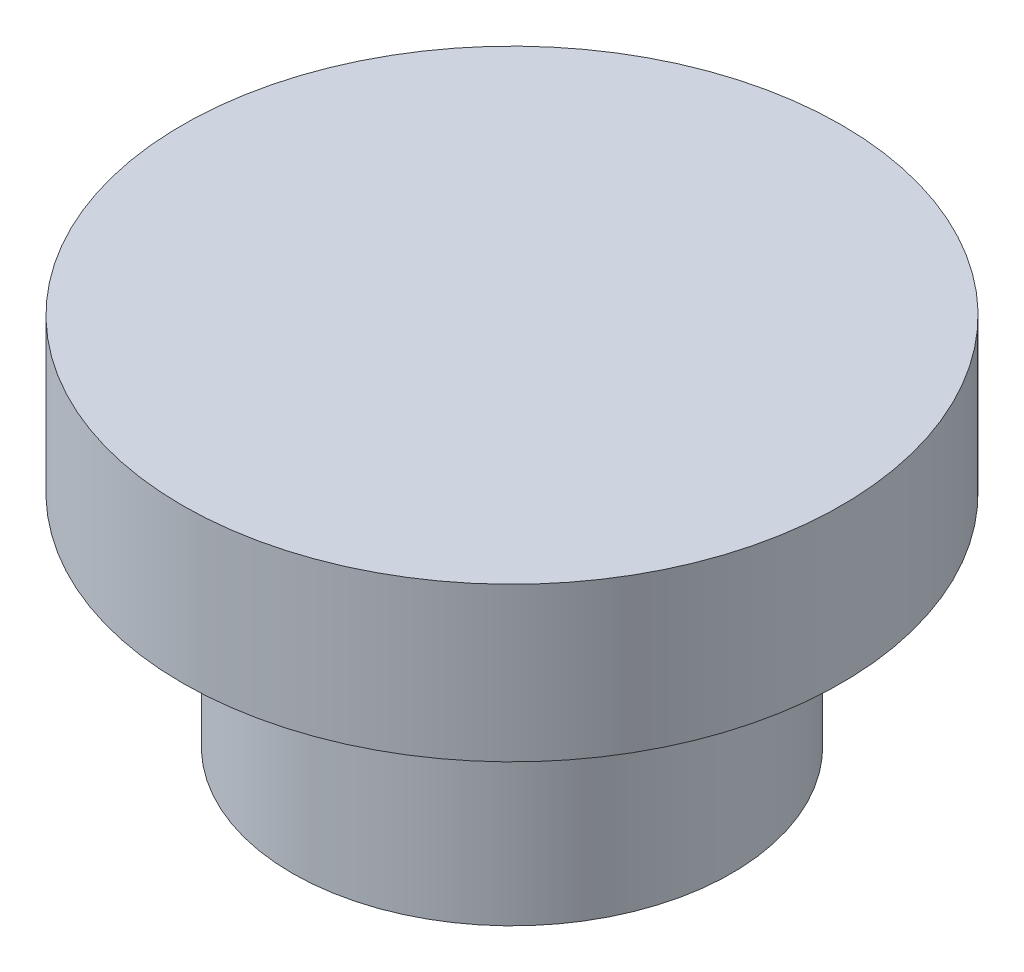
ISO-10303-21;
HEADER;
FILE_DESCRIPTION(('STEP AP214'),'2;1');
FILE_NAME('part.step','',(''),(''),'','','');
FILE_SCHEMA(('AUTOMOTIVE_DESIGN { 1 0 10303 214 1 1 1 1 }'));
ENDSEC;
DATA;
#1=APPLICATION_CONTEXT('core data for automotive mechanical design processes');
#2=APPLICATION_PROTOCOL_DEFINITION('international standard','automotive_design',2000,#1);
#3=PRODUCT_CONTEXT('',#1,'mechanical');
#4=PRODUCT('Part','Part','',(#3));
#5=PRODUCT_RELATED_PRODUCT_CATEGORY('part','',(#4));
#6=PRODUCT_DEFINITION_FORMATION('','',#4);
#7=PRODUCT_DEFINITION_CONTEXT('part definition',#1,'design');
#8=PRODUCT_DEFINITION('design','',#6,#7);
#9=PRODUCT_DEFINITION_SHAPE('','',#8);
#10=(LENGTH_UNIT() NAMED_UNIT(*) SI_UNIT(.MILLI.,.METRE.));
#11=(NAMED_UNIT(*) PLANE_ANGLE_UNIT() SI_UNIT($,.RADIAN.));
#12=(NAMED_UNIT(*) SI_UNIT($,.STERADIAN.) SOLID_ANGLE_UNIT());
#13=UNCERTAINTY_MEASURE_WITH_UNIT(LENGTH_MEASURE(1.E-05),#10,'distance_accuracy_value','');
#14=(GEOMETRIC_REPRESENTATION_CONTEXT(3) GLOBAL_UNCERTAINTY_ASSIGNED_CONTEXT((#13)) GLOBAL_UNIT_ASSIGNED_CONTEXT((#10,
#11,#12)) REPRESENTATION_CONTEXT('',''));
#15=CARTESIAN_POINT('',(0.,0.,0.));
#16=DIRECTION('',(0.,0.,1.));
#17=DIRECTION('',(1.,0.,0.));
#18=AXIS2_PLACEMENT_3D('',#15,#16,#17);
#19=CARTESIAN_POINT('',(0.,7.,0.));
#20=DIRECTION('',(0.,-1.,0.));
#21=DIRECTION('',(0.,0.,-1.));
#22=AXIS2_PLACEMENT_3D('',#19,#20,#21);
#23=CYLINDRICAL_SURFACE('',#22,15.);
#24=CARTESIAN_POINT('',(0.,7.,0.));
#25=DIRECTION('',(0.,1.,0.));
#26=DIRECTION('',(0.,0.,1.));
#27=AXIS2_PLACEMENT_3D('',#24,#25,#26);
#28=CIRCLE('',#27,15.);
#29=CARTESIAN_POINT('',(0.,7.,15.));
#30=VERTEX_POINT('',#29);
#31=EDGE_CURVE('E44',#30,#30,#28,.T.);
#32=ORIENTED_EDGE('',*,*,#31,.F.);
#33=EDGE_LOOP('',(#32));
#34=FACE_BOUND('',#33,.T.);
#35=CARTESIAN_POINT('',(0.,0.,0.));
#36=DIRECTION('',(0.,1.,0.));
#37=DIRECTION('',(0.,0.,1.));
#38=AXIS2_PLACEMENT_3D('',#35,#36,#37);
#39=CIRCLE('',#38,15.);
#40=CARTESIAN_POINT('',(0.,0.,15.));
#41=VERTEX_POINT('',#40);
#42=EDGE_CURVE('E40',#41,#41,#39,.T.);
#43=ORIENTED_EDGE('',*,*,#42,.T.);
#44=EDGE_LOOP('',(#43));
#45=FACE_BOUND('',#44,.T.);
#46=ADVANCED_FACE('F37',(#34,#45),#23,.T.);
#47=CARTESIAN_POINT('',(0.,7.,0.));
#48=DIRECTION('',(0.,1.,0.));
#49=DIRECTION('',(0.,0.,1.));
#50=AXIS2_PLACEMENT_3D('',#47,#48,#49);
#51=PLANE('',#50);
#52=ORIENTED_EDGE('',*,*,#31,.T.);
#53=EDGE_LOOP('',(#52));
#54=FACE_BOUND('',#53,.T.);
#55=ADVANCED_FACE('F61',(#54),#51,.T.);
#56=CARTESIAN_POINT('',(0.,0.,0.));
#57=DIRECTION('',(0.,1.,0.));
#58=DIRECTION('',(0.,0.,1.));
#59=AXIS2_PLACEMENT_3D('',#56,#57,#58);
#60=PLANE('',#59);
#61=CARTESIAN_POINT('',(0.,0.,0.));
#62=DIRECTION('',(0.,-1.,0.));
#63=DIRECTION('',(0.,0.,-1.));
#64=AXIS2_PLACEMENT_3D('',#61,#62,#63);
#65=CIRCLE('',#64,10.);
#66=CARTESIAN_POINT('',(0.,0.,-10.));
#67=VERTEX_POINT('',#66);
#68=EDGE_CURVE('E10',#67,#67,#65,.T.);
#69=ORIENTED_EDGE('',*,*,#68,.F.);
#70=EDGE_LOOP('',(#69));
#71=FACE_BOUND('',#70,.T.);
#72=ORIENTED_EDGE('',*,*,#42,.F.);
#73=EDGE_LOOP('',(#72));
#74=FACE_BOUND('',#73,.T.);
#75=ADVANCED_FACE('F58',(#71,#74),#60,.F.);
#76=CARTESIAN_POINT('',(0.,-9.99999999999999,0.));
#77=DIRECTION('',(0.,1.,0.));
#78=DIRECTION('',(0.,0.,1.));
#79=AXIS2_PLACEMENT_3D('',#76,#77,#78);
#80=CYLINDRICAL_SURFACE('',#79,10.);
#81=CARTESIAN_POINT('',(0.,-9.99999999999999,0.));
#82=DIRECTION('',(0.,-1.,0.));
#83=DIRECTION('',(0.,0.,-1.));
#84=AXIS2_PLACEMENT_3D('',#81,#82,#83);
#85=CIRCLE('',#84,10.);
#86=CARTESIAN_POINT('',(0.,-9.99999999999999,-10.));
#87=VERTEX_POINT('',#86);
#88=EDGE_CURVE('E50',#87,#87,#85,.T.);
#89=ORIENTED_EDGE('',*,*,#88,.F.);
#90=EDGE_LOOP('',(#89));
#91=FACE_BOUND('',#90,.T.);
#92=ORIENTED_EDGE('',*,*,#68,.T.);
#93=EDGE_LOOP('',(#92));
#94=FACE_BOUND('',#93,.T.);
#95=ADVANCED_FACE('F60',(#91,#94),#80,.T.);
#96=CARTESIAN_POINT('',(0.,-9.99999999999999,0.));
#97=DIRECTION('',(0.,-1.,0.));
#98=DIRECTION('',(0.,0.,-1.));
#99=AXIS2_PLACEMENT_3D('',#96,#97,#98);
#100=PLANE('',#99);
#101=ORIENTED_EDGE('',*,*,#88,.T.);
#102=EDGE_LOOP('',(#101));
#103=FACE_BOUND('',#102,.T.);
#104=ADVANCED_FACE('F67',(#103),#100,.T.);
#105=CLOSED_SHELL('',(#46,#55,#75,#95,#104));
#106=MANIFOLD_SOLID_BREP('B2',#105);
#107=ADVANCED_BREP_SHAPE_REPRESENTATION('',(#18,#106),#14);
#108=SHAPE_DEFINITION_REPRESENTATION(#9,#107);
ENDSEC;
END-ISO-10303-21;
